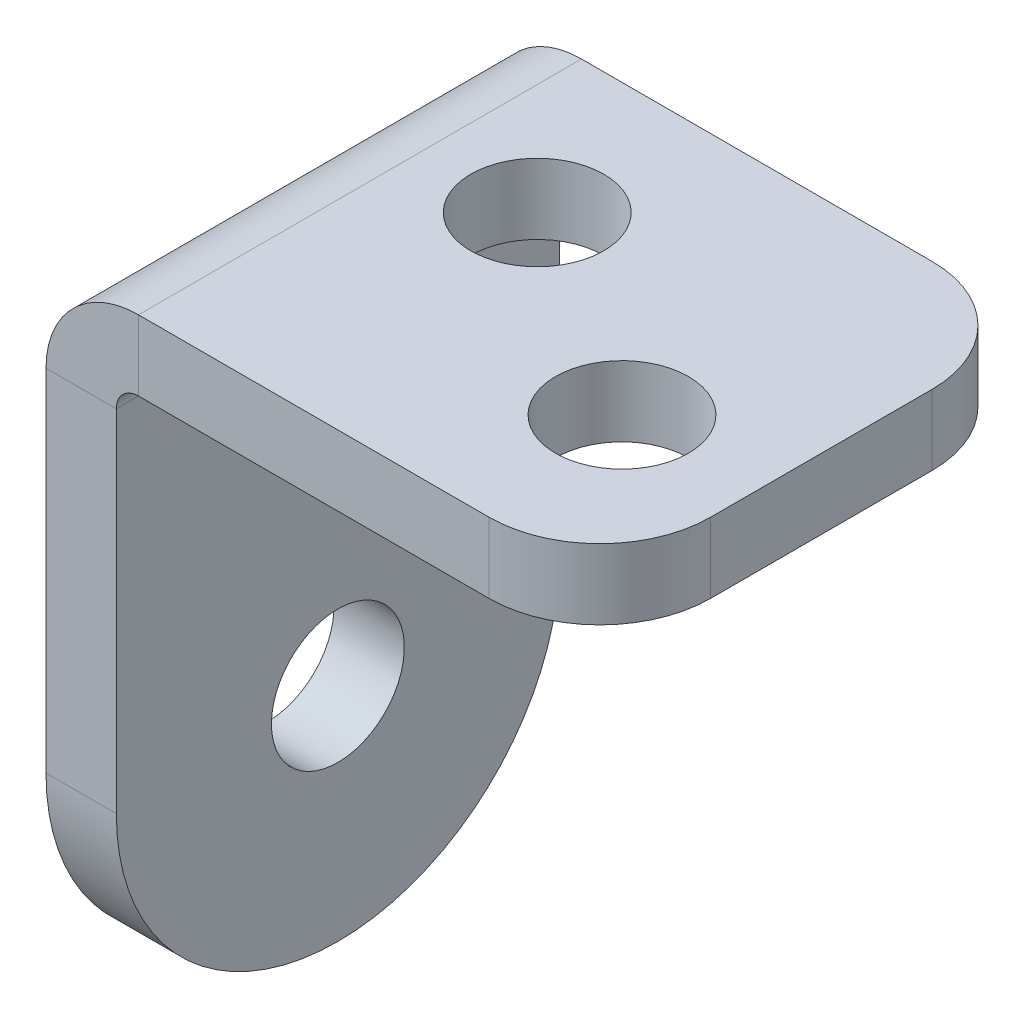
ISO-10303-21;
HEADER;
FILE_DESCRIPTION(('STEP AP214'),'2;1');
FILE_NAME('part.step','',(''),(''),'','','');
FILE_SCHEMA(('AUTOMOTIVE_DESIGN { 1 0 10303 214 1 1 1 1 }'));
ENDSEC;
DATA;
#1=APPLICATION_CONTEXT('core data for automotive mechanical design processes');
#2=APPLICATION_PROTOCOL_DEFINITION('international standard','automotive_design',2000,#1);
#3=PRODUCT_CONTEXT('',#1,'mechanical');
#4=PRODUCT('Part','Part','',(#3));
#5=PRODUCT_RELATED_PRODUCT_CATEGORY('part','',(#4));
#6=PRODUCT_DEFINITION_FORMATION('','',#4);
#7=PRODUCT_DEFINITION_CONTEXT('part definition',#1,'design');
#8=PRODUCT_DEFINITION('design','',#6,#7);
#9=PRODUCT_DEFINITION_SHAPE('','',#8);
#10=(LENGTH_UNIT() NAMED_UNIT(*) SI_UNIT(.MILLI.,.METRE.));
#11=(NAMED_UNIT(*) PLANE_ANGLE_UNIT() SI_UNIT($,.RADIAN.));
#12=(NAMED_UNIT(*) SI_UNIT($,.STERADIAN.) SOLID_ANGLE_UNIT());
#13=UNCERTAINTY_MEASURE_WITH_UNIT(LENGTH_MEASURE(1.E-05),#10,'distance_accuracy_value','');
#14=(GEOMETRIC_REPRESENTATION_CONTEXT(3) GLOBAL_UNCERTAINTY_ASSIGNED_CONTEXT((#13)) GLOBAL_UNIT_ASSIGNED_CONTEXT((#10,
#11,#12)) REPRESENTATION_CONTEXT('',''));
#15=CARTESIAN_POINT('',(0.,0.,0.));
#16=DIRECTION('',(0.,0.,1.));
#17=DIRECTION('',(1.,0.,0.));
#18=AXIS2_PLACEMENT_3D('',#15,#16,#17);
#19=CARTESIAN_POINT('',(4.175,30.,20.));
#20=DIRECTION('',(0.,0.,1.));
#21=DIRECTION('',(1.,0.,0.));
#22=AXIS2_PLACEMENT_3D('',#19,#20,#21);
#23=PLANE('',#22);
#24=DIRECTION('',(0.,-1.,0.));
#25=VECTOR('',#24,1.);
#26=CARTESIAN_POINT('',(4.175,30.,20.));
#27=LINE('',#26,#25);
#28=CARTESIAN_POINT('',(4.175,30.,20.));
#29=VERTEX_POINT('',#28);
#30=CARTESIAN_POINT('',(4.175,26.825,20.));
#31=VERTEX_POINT('',#30);
#32=EDGE_CURVE('E124',#29,#31,#27,.T.);
#33=ORIENTED_EDGE('',*,*,#32,.F.);
#34=CARTESIAN_POINT('',(4.175,25.825,20.));
#35=DIRECTION('',(0.,0.,1.));
#36=DIRECTION('',(1.,0.,0.));
#37=AXIS2_PLACEMENT_3D('',#34,#35,#36);
#38=CIRCLE('',#37,4.175);
#39=CARTESIAN_POINT('',(0.,25.825,20.));
#40=VERTEX_POINT('',#39);
#41=EDGE_CURVE('E128',#40,#29,#38,.F.);
#42=ORIENTED_EDGE('',*,*,#41,.F.);
#43=DIRECTION('',(-1.,0.,0.));
#44=VECTOR('',#43,1.);
#45=CARTESIAN_POINT('',(3.175,25.825,20.));
#46=LINE('',#45,#44);
#47=CARTESIAN_POINT('',(3.175,25.825,20.));
#48=VERTEX_POINT('',#47);
#49=EDGE_CURVE('E133',#48,#40,#46,.T.);
#50=ORIENTED_EDGE('',*,*,#49,.F.);
#51=CARTESIAN_POINT('',(4.175,25.825,20.));
#52=DIRECTION('',(0.,0.,1.));
#53=DIRECTION('',(1.,0.,0.));
#54=AXIS2_PLACEMENT_3D('',#51,#52,#53);
#55=CIRCLE('',#54,1.);
#56=EDGE_CURVE('E130',#48,#31,#55,.F.);
#57=ORIENTED_EDGE('',*,*,#56,.T.);
#58=EDGE_LOOP('',(#33,#42,#50,#57));
#59=FACE_BOUND('',#58,.T.);
#60=ADVANCED_FACE('F37',(#59),#23,.T.);
#61=CARTESIAN_POINT('',(3.175,25.825,20.));
#62=DIRECTION('',(0.,0.,1.));
#63=DIRECTION('',(1.,0.,0.));
#64=AXIS2_PLACEMENT_3D('',#61,#62,#63);
#65=PLANE('',#64);
#66=DIRECTION('',(1.,0.,0.));
#67=VECTOR('',#66,1.);
#68=CARTESIAN_POINT('',(0.,26.825,20.));
#69=LINE('',#68,#67);
#70=CARTESIAN_POINT('',(20.,26.825,20.));
#71=VERTEX_POINT('',#70);
#72=EDGE_CURVE('E148',#31,#71,#69,.T.);
#73=ORIENTED_EDGE('',*,*,#72,.T.);
#74=DIRECTION('',(0.,-1.,0.));
#75=VECTOR('',#74,1.);
#76=CARTESIAN_POINT('',(20.,25.825,20.));
#77=LINE('',#76,#75);
#78=CARTESIAN_POINT('',(20.,30.,20.));
#79=VERTEX_POINT('',#78);
#80=EDGE_CURVE('E60',#71,#79,#77,.F.);
#81=ORIENTED_EDGE('',*,*,#80,.T.);
#82=DIRECTION('',(1.,0.,0.));
#83=VECTOR('',#82,1.);
#84=CARTESIAN_POINT('',(0.,30.,20.));
#85=LINE('',#84,#83);
#86=EDGE_CURVE('E138',#29,#79,#85,.T.);
#87=ORIENTED_EDGE('',*,*,#86,.F.);
#88=ORIENTED_EDGE('',*,*,#32,.T.);
#89=EDGE_LOOP('',(#73,#81,#87,#88));
#90=FACE_BOUND('',#89,.T.);
#91=ADVANCED_FACE('F147',(#90),#65,.T.);
#92=CARTESIAN_POINT('',(0.,25.825,0.));
#93=DIRECTION('',(0.,0.,-1.));
#94=DIRECTION('',(-1.,0.,0.));
#95=AXIS2_PLACEMENT_3D('',#92,#93,#94);
#96=PLANE('',#95);
#97=DIRECTION('',(1.,0.,0.));
#98=VECTOR('',#97,1.);
#99=CARTESIAN_POINT('',(0.,25.825,0.));
#100=LINE('',#99,#98);
#101=CARTESIAN_POINT('',(0.,25.825,0.));
#102=VERTEX_POINT('',#101);
#103=CARTESIAN_POINT('',(3.175,25.825,0.));
#104=VERTEX_POINT('',#103);
#105=EDGE_CURVE('E188',#102,#104,#100,.T.);
#106=ORIENTED_EDGE('',*,*,#105,.F.);
#107=CARTESIAN_POINT('',(4.175,25.825,0.));
#108=DIRECTION('',(0.,0.,1.));
#109=DIRECTION('',(1.,0.,0.));
#110=AXIS2_PLACEMENT_3D('',#107,#108,#109);
#111=CIRCLE('',#110,4.175);
#112=CARTESIAN_POINT('',(4.175,30.,0.));
#113=VERTEX_POINT('',#112);
#114=EDGE_CURVE('E167',#102,#113,#111,.F.);
#115=ORIENTED_EDGE('',*,*,#114,.T.);
#116=DIRECTION('',(0.,1.,0.));
#117=VECTOR('',#116,1.);
#118=CARTESIAN_POINT('',(4.175,26.825,0.));
#119=LINE('',#118,#117);
#120=CARTESIAN_POINT('',(4.175,26.825,0.));
#121=VERTEX_POINT('',#120);
#122=EDGE_CURVE('E186',#121,#113,#119,.T.);
#123=ORIENTED_EDGE('',*,*,#122,.F.);
#124=CARTESIAN_POINT('',(4.175,25.825,0.));
#125=DIRECTION('',(0.,0.,1.));
#126=DIRECTION('',(1.,0.,0.));
#127=AXIS2_PLACEMENT_3D('',#124,#125,#126);
#128=CIRCLE('',#127,1.);
#129=EDGE_CURVE('E173',#104,#121,#128,.F.);
#130=ORIENTED_EDGE('',*,*,#129,.F.);
#131=EDGE_LOOP('',(#106,#115,#123,#130));
#132=FACE_BOUND('',#131,.T.);
#133=ADVANCED_FACE('F277',(#132),#96,.T.);
#134=CARTESIAN_POINT('',(4.175,26.825,0.));
#135=DIRECTION('',(0.,0.,-1.));
#136=DIRECTION('',(-1.,0.,0.));
#137=AXIS2_PLACEMENT_3D('',#134,#135,#136);
#138=PLANE('',#137);
#139=DIRECTION('',(0.,1.,0.));
#140=VECTOR('',#139,1.);
#141=CARTESIAN_POINT('',(3.175,0.,0.));
#142=LINE('',#141,#140);
#143=CARTESIAN_POINT('',(3.175,10.,0.));
#144=VERTEX_POINT('',#143);
#145=EDGE_CURVE('E171',#144,#104,#142,.T.);
#146=ORIENTED_EDGE('',*,*,#145,.F.);
#147=DIRECTION('',(-1.,0.,0.));
#148=VECTOR('',#147,1.);
#149=CARTESIAN_POINT('',(4.175,10.,0.));
#150=LINE('',#149,#148);
#151=CARTESIAN_POINT('',(0.,10.,0.));
#152=VERTEX_POINT('',#151);
#153=EDGE_CURVE('E132',#144,#152,#150,.T.);
#154=ORIENTED_EDGE('',*,*,#153,.T.);
#155=DIRECTION('',(0.,1.,0.));
#156=VECTOR('',#155,1.);
#157=CARTESIAN_POINT('',(0.,0.,0.));
#158=LINE('',#157,#156);
#159=EDGE_CURVE('E169',#152,#102,#158,.T.);
#160=ORIENTED_EDGE('',*,*,#159,.T.);
#161=ORIENTED_EDGE('',*,*,#105,.T.);
#162=EDGE_LOOP('',(#146,#154,#160,#161));
#163=FACE_BOUND('',#162,.T.);
#164=ADVANCED_FACE('F259',(#163),#138,.T.);
#165=CARTESIAN_POINT('',(0.,26.825,20.));
#166=DIRECTION('',(0.,1.,0.));
#167=DIRECTION('',(0.,0.,1.));
#168=AXIS2_PLACEMENT_3D('',#165,#166,#167);
#169=PLANE('',#168);
#170=CARTESIAN_POINT('',(9.175,26.825,7.));
#171=DIRECTION('',(0.,-1.,0.));
#172=DIRECTION('',(0.,0.,-1.));
#173=AXIS2_PLACEMENT_3D('',#170,#171,#172);
#174=CIRCLE('',#173,2.99999999999998);
#175=CARTESIAN_POINT('',(9.175,26.825,4.00000000000001));
#176=VERTEX_POINT('',#175);
#177=EDGE_CURVE('E242',#176,#176,#174,.T.);
#178=ORIENTED_EDGE('',*,*,#177,.F.);
#179=EDGE_LOOP('',(#178));
#180=FACE_BOUND('',#179,.T.);
#181=CARTESIAN_POINT('',(19.,26.825,13.));
#182=DIRECTION('',(0.,-1.,0.));
#183=DIRECTION('',(0.,0.,-1.));
#184=AXIS2_PLACEMENT_3D('',#181,#182,#183);
#185=CIRCLE('',#184,3.00000000000003);
#186=CARTESIAN_POINT('',(19.,26.825,9.99999999999997));
#187=VERTEX_POINT('',#186);
#188=EDGE_CURVE('E236',#187,#187,#185,.T.);
#189=ORIENTED_EDGE('',*,*,#188,.F.);
#190=EDGE_LOOP('',(#189));
#191=FACE_BOUND('',#190,.T.);
#192=DIRECTION('',(0.,0.,-1.));
#193=VECTOR('',#192,1.);
#194=CARTESIAN_POINT('',(25.,26.825,20.));
#195=LINE('',#194,#193);
#196=CARTESIAN_POINT('',(25.,26.825,15.));
#197=VERTEX_POINT('',#196);
#198=CARTESIAN_POINT('',(25.,26.825,5.));
#199=VERTEX_POINT('',#198);
#200=EDGE_CURVE('E183',#197,#199,#195,.T.);
#201=ORIENTED_EDGE('',*,*,#200,.F.);
#202=CARTESIAN_POINT('',(20.,26.825,15.));
#203=DIRECTION('',(0.,1.,0.));
#204=DIRECTION('',(0.,0.,1.));
#205=AXIS2_PLACEMENT_3D('',#202,#203,#204);
#206=CIRCLE('',#205,5.);
#207=EDGE_CURVE('E219',#197,#71,#206,.F.);
#208=ORIENTED_EDGE('',*,*,#207,.T.);
#209=ORIENTED_EDGE('',*,*,#72,.F.);
#210=DIRECTION('',(0.,0.,-1.));
#211=VECTOR('',#210,1.);
#212=CARTESIAN_POINT('',(4.175,26.825,20.));
#213=LINE('',#212,#211);
#214=EDGE_CURVE('E161',#31,#121,#213,.T.);
#215=ORIENTED_EDGE('',*,*,#214,.T.);
#216=DIRECTION('',(1.,0.,0.));
#217=VECTOR('',#216,1.);
#218=CARTESIAN_POINT('',(0.,26.825,0.));
#219=LINE('',#218,#217);
#220=CARTESIAN_POINT('',(20.,26.825,0.));
#221=VERTEX_POINT('',#220);
#222=EDGE_CURVE('E162',#121,#221,#219,.T.);
#223=ORIENTED_EDGE('',*,*,#222,.T.);
#224=CARTESIAN_POINT('',(20.,26.825,5.));
#225=DIRECTION('',(0.,1.,0.));
#226=DIRECTION('',(0.,0.,1.));
#227=AXIS2_PLACEMENT_3D('',#224,#225,#226);
#228=CIRCLE('',#227,5.);
#229=EDGE_CURVE('E217',#221,#199,#228,.F.);
#230=ORIENTED_EDGE('',*,*,#229,.T.);
#231=EDGE_LOOP('',(#201,#208,#209,#215,#223,#230));
#232=FACE_BOUND('',#231,.T.);
#233=ADVANCED_FACE('F232',(#180,#191,#232),#169,.F.);
#234=CARTESIAN_POINT('',(25.,30.,20.));
#235=DIRECTION('',(1.,0.,0.));
#236=DIRECTION('',(0.,0.,-1.));
#237=AXIS2_PLACEMENT_3D('',#234,#235,#236);
#238=PLANE('',#237);
#239=DIRECTION('',(0.,0.,-1.));
#240=VECTOR('',#239,1.);
#241=CARTESIAN_POINT('',(25.,30.,20.));
#242=LINE('',#241,#240);
#243=CARTESIAN_POINT('',(25.,30.,15.));
#244=VERTEX_POINT('',#243);
#245=CARTESIAN_POINT('',(25.,30.,5.));
#246=VERTEX_POINT('',#245);
#247=EDGE_CURVE('E144',#244,#246,#242,.T.);
#248=ORIENTED_EDGE('',*,*,#247,.F.);
#249=DIRECTION('',(0.,-1.,0.));
#250=VECTOR('',#249,1.);
#251=CARTESIAN_POINT('',(25.,30.,15.));
#252=LINE('',#251,#250);
#253=EDGE_CURVE('E214',#244,#197,#252,.T.);
#254=ORIENTED_EDGE('',*,*,#253,.T.);
#255=ORIENTED_EDGE('',*,*,#200,.T.);
#256=DIRECTION('',(0.,-1.,0.));
#257=VECTOR('',#256,1.);
#258=CARTESIAN_POINT('',(25.,30.,5.));
#259=LINE('',#258,#257);
#260=EDGE_CURVE('E208',#199,#246,#259,.F.);
#261=ORIENTED_EDGE('',*,*,#260,.T.);
#262=EDGE_LOOP('',(#248,#254,#255,#261));
#263=FACE_BOUND('',#262,.T.);
#264=ADVANCED_FACE('F226',(#263),#238,.T.);
#265=CARTESIAN_POINT('',(0.,30.,20.));
#266=DIRECTION('',(0.,1.,0.));
#267=DIRECTION('',(0.,0.,1.));
#268=AXIS2_PLACEMENT_3D('',#265,#266,#267);
#269=PLANE('',#268);
#270=CARTESIAN_POINT('',(9.175,30.,7.));
#271=DIRECTION('',(0.,-1.,0.));
#272=DIRECTION('',(0.,0.,-1.));
#273=AXIS2_PLACEMENT_3D('',#270,#271,#272);
#274=CIRCLE('',#273,2.99999999999998);
#275=CARTESIAN_POINT('',(9.175,30.,4.00000000000001));
#276=VERTEX_POINT('',#275);
#277=EDGE_CURVE('E212',#276,#276,#274,.T.);
#278=ORIENTED_EDGE('',*,*,#277,.T.);
#279=EDGE_LOOP('',(#278));
#280=FACE_BOUND('',#279,.T.);
#281=CARTESIAN_POINT('',(19.,30.,13.));
#282=DIRECTION('',(0.,-1.,0.));
#283=DIRECTION('',(0.,0.,-1.));
#284=AXIS2_PLACEMENT_3D('',#281,#282,#283);
#285=CIRCLE('',#284,3.00000000000003);
#286=CARTESIAN_POINT('',(19.,30.,9.99999999999997));
#287=VERTEX_POINT('',#286);
#288=EDGE_CURVE('E239',#287,#287,#285,.T.);
#289=ORIENTED_EDGE('',*,*,#288,.T.);
#290=EDGE_LOOP('',(#289));
#291=FACE_BOUND('',#290,.T.);
#292=ORIENTED_EDGE('',*,*,#86,.T.);
#293=CARTESIAN_POINT('',(20.,30.,15.));
#294=DIRECTION('',(0.,1.,0.));
#295=DIRECTION('',(0.,0.,1.));
#296=AXIS2_PLACEMENT_3D('',#293,#294,#295);
#297=CIRCLE('',#296,5.);
#298=EDGE_CURVE('E45',#79,#244,#297,.T.);
#299=ORIENTED_EDGE('',*,*,#298,.T.);
#300=ORIENTED_EDGE('',*,*,#247,.T.);
#301=CARTESIAN_POINT('',(20.,30.,5.));
#302=DIRECTION('',(0.,1.,0.));
#303=DIRECTION('',(0.,0.,1.));
#304=AXIS2_PLACEMENT_3D('',#301,#302,#303);
#305=CIRCLE('',#304,5.);
#306=CARTESIAN_POINT('',(20.,30.,0.));
#307=VERTEX_POINT('',#306);
#308=EDGE_CURVE('E52',#246,#307,#305,.T.);
#309=ORIENTED_EDGE('',*,*,#308,.T.);
#310=DIRECTION('',(1.,0.,0.));
#311=VECTOR('',#310,1.);
#312=CARTESIAN_POINT('',(0.,30.,0.));
#313=LINE('',#312,#311);
#314=EDGE_CURVE('E140',#113,#307,#313,.T.);
#315=ORIENTED_EDGE('',*,*,#314,.F.);
#316=DIRECTION('',(0.,0.,-1.));
#317=VECTOR('',#316,1.);
#318=CARTESIAN_POINT('',(4.175,30.,20.));
#319=LINE('',#318,#317);
#320=EDGE_CURVE('E136',#29,#113,#319,.T.);
#321=ORIENTED_EDGE('',*,*,#320,.F.);
#322=EDGE_LOOP('',(#292,#299,#300,#309,#315,#321));
#323=FACE_BOUND('',#322,.T.);
#324=ADVANCED_FACE('F137',(#280,#291,#323),#269,.T.);
#325=CARTESIAN_POINT('',(4.175,25.825,20.));
#326=DIRECTION('',(0.,0.,-1.));
#327=DIRECTION('',(-1.,0.,0.));
#328=AXIS2_PLACEMENT_3D('',#325,#326,#327);
#329=CYLINDRICAL_SURFACE('',#328,4.175);
#330=ORIENTED_EDGE('',*,*,#114,.F.);
#331=DIRECTION('',(0.,0.,-1.));
#332=VECTOR('',#331,1.);
#333=CARTESIAN_POINT('',(0.,25.825,20.));
#334=LINE('',#333,#332);
#335=EDGE_CURVE('E145',#40,#102,#334,.T.);
#336=ORIENTED_EDGE('',*,*,#335,.F.);
#337=ORIENTED_EDGE('',*,*,#41,.T.);
#338=ORIENTED_EDGE('',*,*,#320,.T.);
#339=EDGE_LOOP('',(#330,#336,#337,#338));
#340=FACE_BOUND('',#339,.T.);
#341=ADVANCED_FACE('F151',(#340),#329,.T.);
#342=CARTESIAN_POINT('',(0.,0.,20.));
#343=DIRECTION('',(-1.,0.,0.));
#344=DIRECTION('',(0.,0.,1.));
#345=AXIS2_PLACEMENT_3D('',#342,#343,#344);
#346=PLANE('',#345);
#347=CARTESIAN_POINT('',(0.,10.,10.));
#348=DIRECTION('',(-1.,0.,0.));
#349=DIRECTION('',(0.,0.,1.));
#350=AXIS2_PLACEMENT_3D('',#347,#348,#349);
#351=CIRCLE('',#350,3.);
#352=CARTESIAN_POINT('',(0.,10.,13.));
#353=VERTEX_POINT('',#352);
#354=EDGE_CURVE('E195',#353,#353,#351,.T.);
#355=ORIENTED_EDGE('',*,*,#354,.F.);
#356=EDGE_LOOP('',(#355));
#357=FACE_BOUND('',#356,.T.);
#358=ORIENTED_EDGE('',*,*,#159,.F.);
#359=CARTESIAN_POINT('',(0.,10.,10.));
#360=DIRECTION('',(-1.,0.,0.));
#361=DIRECTION('',(0.,0.,1.));
#362=AXIS2_PLACEMENT_3D('',#359,#360,#361);
#363=CIRCLE('',#362,10.);
#364=CARTESIAN_POINT('',(0.,0.,10.));
#365=VERTEX_POINT('',#364);
#366=EDGE_CURVE('E200',#152,#365,#363,.T.);
#367=ORIENTED_EDGE('',*,*,#366,.T.);
#368=CARTESIAN_POINT('',(0.,10.,10.));
#369=DIRECTION('',(-1.,0.,0.));
#370=DIRECTION('',(0.,0.,1.));
#371=AXIS2_PLACEMENT_3D('',#368,#369,#370);
#372=CIRCLE('',#371,10.);
#373=CARTESIAN_POINT('',(0.,10.,20.));
#374=VERTEX_POINT('',#373);
#375=EDGE_CURVE('E198',#365,#374,#372,.T.);
#376=ORIENTED_EDGE('',*,*,#375,.T.);
#377=DIRECTION('',(0.,1.,0.));
#378=VECTOR('',#377,1.);
#379=CARTESIAN_POINT('',(0.,0.,20.));
#380=LINE('',#379,#378);
#381=EDGE_CURVE('E153',#374,#40,#380,.T.);
#382=ORIENTED_EDGE('',*,*,#381,.T.);
#383=ORIENTED_EDGE('',*,*,#335,.T.);
#384=EDGE_LOOP('',(#358,#367,#376,#382,#383));
#385=FACE_BOUND('',#384,.T.);
#386=ADVANCED_FACE('F381',(#357,#385),#346,.T.);
#387=CARTESIAN_POINT('',(3.175,0.,20.));
#388=DIRECTION('',(-1.,0.,0.));
#389=DIRECTION('',(0.,0.,1.));
#390=AXIS2_PLACEMENT_3D('',#387,#388,#389);
#391=PLANE('',#390);
#392=CARTESIAN_POINT('',(3.175,10.,10.));
#393=DIRECTION('',(-1.,0.,0.));
#394=DIRECTION('',(0.,0.,1.));
#395=AXIS2_PLACEMENT_3D('',#392,#393,#394);
#396=CIRCLE('',#395,3.);
#397=CARTESIAN_POINT('',(3.175,10.,13.));
#398=VERTEX_POINT('',#397);
#399=EDGE_CURVE('E165',#398,#398,#396,.T.);
#400=ORIENTED_EDGE('',*,*,#399,.T.);
#401=EDGE_LOOP('',(#400));
#402=FACE_BOUND('',#401,.T.);
#403=CARTESIAN_POINT('',(3.175,10.,10.));
#404=DIRECTION('',(-1.,0.,0.));
#405=DIRECTION('',(0.,0.,1.));
#406=AXIS2_PLACEMENT_3D('',#403,#404,#405);
#407=CIRCLE('',#406,10.);
#408=CARTESIAN_POINT('',(3.175,10.,20.));
#409=VERTEX_POINT('',#408);
#410=CARTESIAN_POINT('',(3.175,0.,10.));
#411=VERTEX_POINT('',#410);
#412=EDGE_CURVE('E202',#409,#411,#407,.F.);
#413=ORIENTED_EDGE('',*,*,#412,.T.);
#414=CARTESIAN_POINT('',(3.175,10.,10.));
#415=DIRECTION('',(-1.,0.,0.));
#416=DIRECTION('',(0.,0.,1.));
#417=AXIS2_PLACEMENT_3D('',#414,#415,#416);
#418=CIRCLE('',#417,10.);
#419=EDGE_CURVE('E204',#411,#144,#418,.F.);
#420=ORIENTED_EDGE('',*,*,#419,.T.);
#421=ORIENTED_EDGE('',*,*,#145,.T.);
#422=DIRECTION('',(0.,0.,-1.));
#423=VECTOR('',#422,1.);
#424=CARTESIAN_POINT('',(3.175,25.825,20.));
#425=LINE('',#424,#423);
#426=EDGE_CURVE('E178',#48,#104,#425,.T.);
#427=ORIENTED_EDGE('',*,*,#426,.F.);
#428=DIRECTION('',(0.,1.,0.));
#429=VECTOR('',#428,1.);
#430=CARTESIAN_POINT('',(3.175,0.,20.));
#431=LINE('',#430,#429);
#432=EDGE_CURVE('E155',#409,#48,#431,.T.);
#433=ORIENTED_EDGE('',*,*,#432,.F.);
#434=EDGE_LOOP('',(#413,#420,#421,#427,#433));
#435=FACE_BOUND('',#434,.T.);
#436=ADVANCED_FACE('F371',(#402,#435),#391,.F.);
#437=CARTESIAN_POINT('',(4.175,25.825,20.));
#438=DIRECTION('',(0.,0.,-1.));
#439=DIRECTION('',(-1.,0.,0.));
#440=AXIS2_PLACEMENT_3D('',#437,#438,#439);
#441=CYLINDRICAL_SURFACE('',#440,1.);
#442=ORIENTED_EDGE('',*,*,#129,.T.);
#443=ORIENTED_EDGE('',*,*,#214,.F.);
#444=ORIENTED_EDGE('',*,*,#56,.F.);
#445=ORIENTED_EDGE('',*,*,#426,.T.);
#446=EDGE_LOOP('',(#442,#443,#444,#445));
#447=FACE_BOUND('',#446,.T.);
#448=ADVANCED_FACE('F365',(#447),#441,.F.);
#449=CARTESIAN_POINT('',(4.175,25.825,20.));
#450=DIRECTION('',(0.,0.,1.));
#451=DIRECTION('',(1.,0.,0.));
#452=AXIS2_PLACEMENT_3D('',#449,#450,#451);
#453=PLANE('',#452);
#454=ORIENTED_EDGE('',*,*,#381,.F.);
#455=DIRECTION('',(-1.,0.,0.));
#456=VECTOR('',#455,1.);
#457=CARTESIAN_POINT('',(4.175,10.,20.));
#458=LINE('',#457,#456);
#459=EDGE_CURVE('E206',#374,#409,#458,.F.);
#460=ORIENTED_EDGE('',*,*,#459,.T.);
#461=ORIENTED_EDGE('',*,*,#432,.T.);
#462=ORIENTED_EDGE('',*,*,#49,.T.);
#463=EDGE_LOOP('',(#454,#460,#461,#462));
#464=FACE_BOUND('',#463,.T.);
#465=ADVANCED_FACE('F370',(#464),#453,.T.);
#466=CARTESIAN_POINT('',(4.175,25.825,0.));
#467=DIRECTION('',(0.,0.,1.));
#468=DIRECTION('',(1.,0.,0.));
#469=AXIS2_PLACEMENT_3D('',#466,#467,#468);
#470=PLANE('',#469);
#471=ORIENTED_EDGE('',*,*,#314,.T.);
#472=DIRECTION('',(0.,-1.,0.));
#473=VECTOR('',#472,1.);
#474=CARTESIAN_POINT('',(20.,26.825,0.));
#475=LINE('',#474,#473);
#476=EDGE_CURVE('E11',#307,#221,#475,.T.);
#477=ORIENTED_EDGE('',*,*,#476,.T.);
#478=ORIENTED_EDGE('',*,*,#222,.F.);
#479=ORIENTED_EDGE('',*,*,#122,.T.);
#480=EDGE_LOOP('',(#471,#477,#478,#479));
#481=FACE_BOUND('',#480,.T.);
#482=ADVANCED_FACE('F344',(#481),#470,.F.);
#483=CARTESIAN_POINT('',(25.,10.,10.));
#484=DIRECTION('',(-1.,0.,0.));
#485=DIRECTION('',(0.,0.,1.));
#486=AXIS2_PLACEMENT_3D('',#483,#484,#485);
#487=CYLINDRICAL_SURFACE('',#486,3.);
#488=ORIENTED_EDGE('',*,*,#354,.T.);
#489=EDGE_LOOP('',(#488));
#490=FACE_BOUND('',#489,.T.);
#491=ORIENTED_EDGE('',*,*,#399,.F.);
#492=EDGE_LOOP('',(#491));
#493=FACE_BOUND('',#492,.T.);
#494=ADVANCED_FACE('F287',(#490,#493),#487,.F.);
#495=CARTESIAN_POINT('',(3.175,10.,10.));
#496=DIRECTION('',(-1.,0.,0.));
#497=DIRECTION('',(0.,0.,1.));
#498=AXIS2_PLACEMENT_3D('',#495,#496,#497);
#499=CYLINDRICAL_SURFACE('',#498,10.);
#500=DIRECTION('',(-1.,0.,0.));
#501=VECTOR('',#500,1.);
#502=CARTESIAN_POINT('',(3.175,0.,10.));
#503=LINE('',#502,#501);
#504=EDGE_CURVE('E209',#411,#365,#503,.T.);
#505=ORIENTED_EDGE('',*,*,#504,.F.);
#506=ORIENTED_EDGE('',*,*,#412,.F.);
#507=ORIENTED_EDGE('',*,*,#459,.F.);
#508=ORIENTED_EDGE('',*,*,#375,.F.);
#509=EDGE_LOOP('',(#505,#506,#507,#508));
#510=FACE_BOUND('',#509,.T.);
#511=ADVANCED_FACE('F284',(#510),#499,.T.);
#512=CARTESIAN_POINT('',(4.175,10.,10.));
#513=DIRECTION('',(-1.,0.,0.));
#514=DIRECTION('',(0.,0.,1.));
#515=AXIS2_PLACEMENT_3D('',#512,#513,#514);
#516=CYLINDRICAL_SURFACE('',#515,10.);
#517=ORIENTED_EDGE('',*,*,#419,.F.);
#518=ORIENTED_EDGE('',*,*,#504,.T.);
#519=ORIENTED_EDGE('',*,*,#366,.F.);
#520=ORIENTED_EDGE('',*,*,#153,.F.);
#521=EDGE_LOOP('',(#517,#518,#519,#520));
#522=FACE_BOUND('',#521,.T.);
#523=ADVANCED_FACE('F281',(#522),#516,.T.);
#524=CARTESIAN_POINT('',(20.,30.,15.));
#525=DIRECTION('',(0.,-1.,0.));
#526=DIRECTION('',(0.,0.,-1.));
#527=AXIS2_PLACEMENT_3D('',#524,#525,#526);
#528=CYLINDRICAL_SURFACE('',#527,5.);
#529=ORIENTED_EDGE('',*,*,#298,.F.);
#530=ORIENTED_EDGE('',*,*,#80,.F.);
#531=ORIENTED_EDGE('',*,*,#207,.F.);
#532=ORIENTED_EDGE('',*,*,#253,.F.);
#533=EDGE_LOOP('',(#529,#530,#531,#532));
#534=FACE_BOUND('',#533,.T.);
#535=ADVANCED_FACE('F229',(#534),#528,.T.);
#536=CARTESIAN_POINT('',(20.,25.825,5.));
#537=DIRECTION('',(0.,1.,0.));
#538=DIRECTION('',(0.,0.,1.));
#539=AXIS2_PLACEMENT_3D('',#536,#537,#538);
#540=CYLINDRICAL_SURFACE('',#539,5.);
#541=ORIENTED_EDGE('',*,*,#308,.F.);
#542=ORIENTED_EDGE('',*,*,#260,.F.);
#543=ORIENTED_EDGE('',*,*,#229,.F.);
#544=ORIENTED_EDGE('',*,*,#476,.F.);
#545=EDGE_LOOP('',(#541,#542,#543,#544));
#546=FACE_BOUND('',#545,.T.);
#547=ADVANCED_FACE('F39',(#546),#540,.T.);
#548=CARTESIAN_POINT('',(19.,30.,13.));
#549=DIRECTION('',(0.,-1.,0.));
#550=DIRECTION('',(0.,0.,-1.));
#551=AXIS2_PLACEMENT_3D('',#548,#549,#550);
#552=CYLINDRICAL_SURFACE('',#551,3.00000000000003);
#553=ORIENTED_EDGE('',*,*,#288,.F.);
#554=EDGE_LOOP('',(#553));
#555=FACE_BOUND('',#554,.T.);
#556=ORIENTED_EDGE('',*,*,#188,.T.);
#557=EDGE_LOOP('',(#556));
#558=FACE_BOUND('',#557,.T.);
#559=ADVANCED_FACE('F253',(#555,#558),#552,.F.);
#560=CARTESIAN_POINT('',(9.175,30.,7.));
#561=DIRECTION('',(0.,-1.,0.));
#562=DIRECTION('',(0.,0.,-1.));
#563=AXIS2_PLACEMENT_3D('',#560,#561,#562);
#564=CYLINDRICAL_SURFACE('',#563,2.99999999999998);
#565=ORIENTED_EDGE('',*,*,#277,.F.);
#566=EDGE_LOOP('',(#565));
#567=FACE_BOUND('',#566,.T.);
#568=ORIENTED_EDGE('',*,*,#177,.T.);
#569=EDGE_LOOP('',(#568));
#570=FACE_BOUND('',#569,.T.);
#571=ADVANCED_FACE('F250',(#567,#570),#564,.F.);
#572=CLOSED_SHELL('',(#60,#91,#133,#164,#233,#264,#324,#341,#386,#436,#448,#465,#482,#494,#511,
#523,#535,#547,#559,#571));
#573=MANIFOLD_SOLID_BREP('B2',#572);
#574=ADVANCED_BREP_SHAPE_REPRESENTATION('',(#18,#573),#14);
#575=SHAPE_DEFINITION_REPRESENTATION(#9,#574);
ENDSEC;
END-ISO-10303-21;
